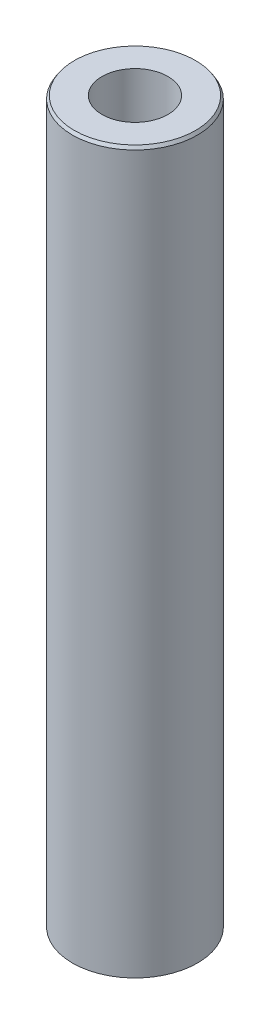
ISO-10303-21;
HEADER;
FILE_DESCRIPTION(('STEP AP214'),'2;1');
FILE_NAME('part.step','',(''),(''),'','','');
FILE_SCHEMA(('AUTOMOTIVE_DESIGN { 1 0 10303 214 1 1 1 1 }'));
ENDSEC;
DATA;
#1=APPLICATION_CONTEXT('core data for automotive mechanical design processes');
#2=APPLICATION_PROTOCOL_DEFINITION('international standard','automotive_design',2000,#1);
#3=PRODUCT_CONTEXT('',#1,'mechanical');
#4=PRODUCT('Part','Part','',(#3));
#5=PRODUCT_RELATED_PRODUCT_CATEGORY('part','',(#4));
#6=PRODUCT_DEFINITION_FORMATION('','',#4);
#7=PRODUCT_DEFINITION_CONTEXT('part definition',#1,'design');
#8=PRODUCT_DEFINITION('design','',#6,#7);
#9=PRODUCT_DEFINITION_SHAPE('','',#8);
#10=(LENGTH_UNIT() NAMED_UNIT(*) SI_UNIT(.MILLI.,.METRE.));
#11=(NAMED_UNIT(*) PLANE_ANGLE_UNIT() SI_UNIT($,.RADIAN.));
#12=(NAMED_UNIT(*) SI_UNIT($,.STERADIAN.) SOLID_ANGLE_UNIT());
#13=UNCERTAINTY_MEASURE_WITH_UNIT(LENGTH_MEASURE(1.E-05),#10,'distance_accuracy_value','');
#14=(GEOMETRIC_REPRESENTATION_CONTEXT(3) GLOBAL_UNCERTAINTY_ASSIGNED_CONTEXT((#13)) GLOBAL_UNIT_ASSIGNED_CONTEXT((#10,
#11,#12)) REPRESENTATION_CONTEXT('',''));
#15=CARTESIAN_POINT('',(0.,0.,0.));
#16=DIRECTION('',(0.,0.,1.));
#17=DIRECTION('',(1.,0.,0.));
#18=AXIS2_PLACEMENT_3D('',#15,#16,#17);
#19=CARTESIAN_POINT('',(0.,461.881009707877,0.));
#20=DIRECTION('',(0.,-1.,0.));
#21=DIRECTION('',(0.,0.,-1.));
#22=AXIS2_PLACEMENT_3D('',#19,#20,#21);
#23=CYLINDRICAL_SURFACE('',#22,40.);
#24=CARTESIAN_POINT('',(0.,459.926171443127,0.));
#25=DIRECTION('',(0.,1.,0.));
#26=DIRECTION('',(0.,0.,1.));
#27=AXIS2_PLACEMENT_3D('',#24,#25,#26);
#28=CIRCLE('',#27,40.);
#29=CARTESIAN_POINT('',(0.,459.926171443127,40.));
#30=VERTEX_POINT('',#29);
#31=EDGE_CURVE('E50',#30,#30,#28,.F.);
#32=ORIENTED_EDGE('',*,*,#31,.T.);
#33=EDGE_LOOP('',(#32));
#34=FACE_BOUND('',#33,.T.);
#35=CARTESIAN_POINT('',(0.,1.2233526040113,0.));
#36=DIRECTION('',(0.,1.,0.));
#37=DIRECTION('',(0.,0.,1.));
#38=AXIS2_PLACEMENT_3D('',#35,#36,#37);
#39=CIRCLE('',#38,40.);
#40=CARTESIAN_POINT('',(0.,1.2233526040113,40.));
#41=VERTEX_POINT('',#40);
#42=EDGE_CURVE('E51',#41,#41,#39,.T.);
#43=ORIENTED_EDGE('',*,*,#42,.T.);
#44=EDGE_LOOP('',(#43));
#45=FACE_BOUND('',#44,.T.);
#46=ADVANCED_FACE('F39',(#34,#45),#23,.T.);
#47=CARTESIAN_POINT('',(0.,461.881009707877,0.));
#48=DIRECTION('',(0.,1.,0.));
#49=DIRECTION('',(0.,0.,1.));
#50=AXIS2_PLACEMENT_3D('',#47,#48,#49);
#51=PLANE('',#50);
#52=CARTESIAN_POINT('',(0.,461.881009707877,0.));
#53=DIRECTION('',(0.,1.,0.));
#54=DIRECTION('',(0.,0.,1.));
#55=AXIS2_PLACEMENT_3D('',#52,#53,#54);
#56=CIRCLE('',#55,38.7766473959888);
#57=CARTESIAN_POINT('',(0.,461.881009707877,38.7766473959888));
#58=VERTEX_POINT('',#57);
#59=EDGE_CURVE('E54',#58,#58,#56,.T.);
#60=ORIENTED_EDGE('',*,*,#59,.T.);
#61=EDGE_LOOP('',(#60));
#62=FACE_BOUND('',#61,.T.);
#63=CARTESIAN_POINT('',(0.,461.881009707877,0.));
#64=DIRECTION('',(0.,1.,0.));
#65=DIRECTION('',(0.,0.,1.));
#66=AXIS2_PLACEMENT_3D('',#63,#64,#65);
#67=CIRCLE('',#66,21.0992508318901);
#68=CARTESIAN_POINT('',(0.,461.881009707877,21.0992508318901));
#69=VERTEX_POINT('',#68);
#70=EDGE_CURVE('E58',#69,#69,#67,.T.);
#71=ORIENTED_EDGE('',*,*,#70,.F.);
#72=EDGE_LOOP('',(#71));
#73=FACE_BOUND('',#72,.T.);
#74=ADVANCED_FACE('F69',(#62,#73),#51,.T.);
#75=CARTESIAN_POINT('',(0.,0.,0.));
#76=DIRECTION('',(0.,1.,0.));
#77=DIRECTION('',(0.,0.,1.));
#78=AXIS2_PLACEMENT_3D('',#75,#76,#77);
#79=PLANE('',#78);
#80=CARTESIAN_POINT('',(0.,0.,0.));
#81=DIRECTION('',(0.,1.,0.));
#82=DIRECTION('',(0.,0.,1.));
#83=AXIS2_PLACEMENT_3D('',#80,#81,#82);
#84=CIRCLE('',#83,38.0451617352502);
#85=CARTESIAN_POINT('',(0.,0.,38.0451617352502));
#86=VERTEX_POINT('',#85);
#87=EDGE_CURVE('E10',#86,#86,#84,.F.);
#88=ORIENTED_EDGE('',*,*,#87,.T.);
#89=EDGE_LOOP('',(#88));
#90=FACE_BOUND('',#89,.T.);
#91=CARTESIAN_POINT('',(0.,0.,0.));
#92=DIRECTION('',(0.,1.,0.));
#93=DIRECTION('',(0.,0.,1.));
#94=AXIS2_PLACEMENT_3D('',#91,#92,#93);
#95=CIRCLE('',#94,21.0992508318901);
#96=CARTESIAN_POINT('',(0.,0.,21.0992508318901));
#97=VERTEX_POINT('',#96);
#98=EDGE_CURVE('E63',#97,#97,#95,.T.);
#99=ORIENTED_EDGE('',*,*,#98,.T.);
#100=EDGE_LOOP('',(#99));
#101=FACE_BOUND('',#100,.T.);
#102=ADVANCED_FACE('F75',(#90,#101),#79,.F.);
#103=CARTESIAN_POINT('',(0.,461.881009707877,0.));
#104=DIRECTION('',(0.,-1.,0.));
#105=DIRECTION('',(0.,0.,-1.));
#106=AXIS2_PLACEMENT_3D('',#103,#104,#105);
#107=CYLINDRICAL_SURFACE('',#106,21.0992508318901);
#108=ORIENTED_EDGE('',*,*,#70,.T.);
#109=EDGE_LOOP('',(#108));
#110=FACE_BOUND('',#109,.T.);
#111=ORIENTED_EDGE('',*,*,#98,.F.);
#112=EDGE_LOOP('',(#111));
#113=FACE_BOUND('',#112,.T.);
#114=ADVANCED_FACE('F70',(#110,#113),#107,.F.);
#115=CARTESIAN_POINT('',(0.,461.881009707877,0.));
#116=DIRECTION('',(0.,-1.,0.));
#117=DIRECTION('',(0.,0.,-1.));
#118=AXIS2_PLACEMENT_3D('',#115,#116,#117);
#119=CONICAL_SURFACE('',#118,38.7766473959888,0.559179836353801);
#120=ORIENTED_EDGE('',*,*,#31,.F.);
#121=EDGE_LOOP('',(#120));
#122=FACE_BOUND('',#121,.T.);
#123=ORIENTED_EDGE('',*,*,#59,.F.);
#124=EDGE_LOOP('',(#123));
#125=FACE_BOUND('',#124,.T.);
#126=ADVANCED_FACE('F81',(#122,#125),#119,.T.);
#127=CARTESIAN_POINT('',(0.,1.2233526040113,0.));
#128=DIRECTION('',(0.,1.,0.));
#129=DIRECTION('',(0.,0.,1.));
#130=AXIS2_PLACEMENT_3D('',#127,#128,#129);
#131=CONICAL_SURFACE('',#130,40.,1.01161649044108);
#132=ORIENTED_EDGE('',*,*,#87,.F.);
#133=EDGE_LOOP('',(#132));
#134=FACE_BOUND('',#133,.T.);
#135=ORIENTED_EDGE('',*,*,#42,.F.);
#136=EDGE_LOOP('',(#135));
#137=FACE_BOUND('',#136,.T.);
#138=ADVANCED_FACE('F45',(#134,#137),#131,.T.);
#139=CLOSED_SHELL('',(#46,#74,#102,#114,#126,#138));
#140=MANIFOLD_SOLID_BREP('B2',#139);
#141=ADVANCED_BREP_SHAPE_REPRESENTATION('',(#18,#140),#14);
#142=SHAPE_DEFINITION_REPRESENTATION(#9,#141);
ENDSEC;
END-ISO-10303-21;
